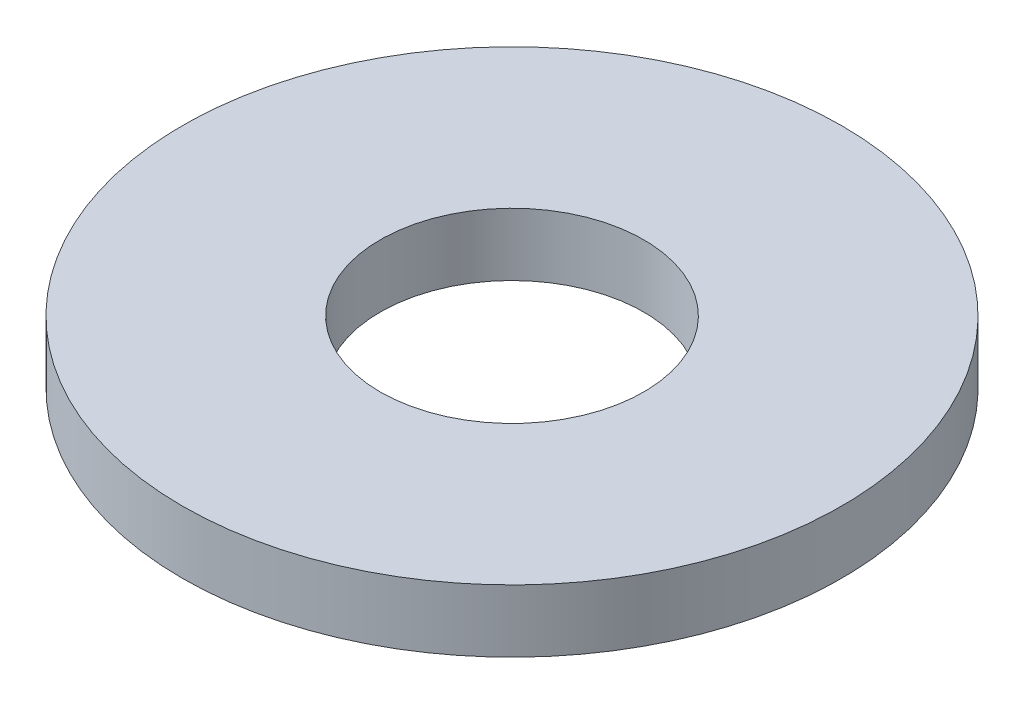
ISO-10303-21;
HEADER;
FILE_DESCRIPTION(('STEP AP214'),'2;1');
FILE_NAME('part.step','',(''),(''),'','','');
FILE_SCHEMA(('AUTOMOTIVE_DESIGN { 1 0 10303 214 1 1 1 1 }'));
ENDSEC;
DATA;
#1=APPLICATION_CONTEXT('core data for automotive mechanical design processes');
#2=APPLICATION_PROTOCOL_DEFINITION('international standard','automotive_design',2000,#1);
#3=PRODUCT_CONTEXT('',#1,'mechanical');
#4=PRODUCT('Part','Part','',(#3));
#5=PRODUCT_RELATED_PRODUCT_CATEGORY('part','',(#4));
#6=PRODUCT_DEFINITION_FORMATION('','',#4);
#7=PRODUCT_DEFINITION_CONTEXT('part definition',#1,'design');
#8=PRODUCT_DEFINITION('design','',#6,#7);
#9=PRODUCT_DEFINITION_SHAPE('','',#8);
#10=(LENGTH_UNIT() NAMED_UNIT(*) SI_UNIT(.MILLI.,.METRE.));
#11=(NAMED_UNIT(*) PLANE_ANGLE_UNIT() SI_UNIT($,.RADIAN.));
#12=(NAMED_UNIT(*) SI_UNIT($,.STERADIAN.) SOLID_ANGLE_UNIT());
#13=UNCERTAINTY_MEASURE_WITH_UNIT(LENGTH_MEASURE(1.E-05),#10,'distance_accuracy_value','');
#14=(GEOMETRIC_REPRESENTATION_CONTEXT(3) GLOBAL_UNCERTAINTY_ASSIGNED_CONTEXT((#13)) GLOBAL_UNIT_ASSIGNED_CONTEXT((#10,
#11,#12)) REPRESENTATION_CONTEXT('',''));
#15=CARTESIAN_POINT('',(0.,0.,0.));
#16=DIRECTION('',(0.,0.,1.));
#17=DIRECTION('',(1.,0.,0.));
#18=AXIS2_PLACEMENT_3D('',#15,#16,#17);
#19=CARTESIAN_POINT('',(0.,19.,0.));
#20=DIRECTION('',(0.,-1.,0.));
#21=DIRECTION('',(0.,0.,-1.));
#22=AXIS2_PLACEMENT_3D('',#19,#20,#21);
#23=CYLINDRICAL_SURFACE('',#22,100.);
#24=CARTESIAN_POINT('',(0.,19.,0.));
#25=DIRECTION('',(0.,1.,0.));
#26=DIRECTION('',(0.,0.,1.));
#27=AXIS2_PLACEMENT_3D('',#24,#25,#26);
#28=CIRCLE('',#27,100.);
#29=CARTESIAN_POINT('',(0.,19.,100.));
#30=VERTEX_POINT('',#29);
#31=EDGE_CURVE('E10',#30,#30,#28,.T.);
#32=ORIENTED_EDGE('',*,*,#31,.F.);
#33=EDGE_LOOP('',(#32));
#34=FACE_BOUND('',#33,.T.);
#35=CARTESIAN_POINT('',(0.,0.,0.));
#36=DIRECTION('',(0.,1.,0.));
#37=DIRECTION('',(0.,0.,1.));
#38=AXIS2_PLACEMENT_3D('',#35,#36,#37);
#39=CIRCLE('',#38,100.);
#40=CARTESIAN_POINT('',(0.,0.,100.));
#41=VERTEX_POINT('',#40);
#42=EDGE_CURVE('E37',#41,#41,#39,.T.);
#43=ORIENTED_EDGE('',*,*,#42,.T.);
#44=EDGE_LOOP('',(#43));
#45=FACE_BOUND('',#44,.T.);
#46=ADVANCED_FACE('F40',(#34,#45),#23,.T.);
#47=CARTESIAN_POINT('',(0.,19.,0.));
#48=DIRECTION('',(0.,1.,0.));
#49=DIRECTION('',(0.,0.,1.));
#50=AXIS2_PLACEMENT_3D('',#47,#48,#49);
#51=PLANE('',#50);
#52=CARTESIAN_POINT('',(0.,19.,0.));
#53=DIRECTION('',(0.,1.,0.));
#54=DIRECTION('',(0.,0.,1.));
#55=AXIS2_PLACEMENT_3D('',#52,#53,#54);
#56=CIRCLE('',#55,40.);
#57=CARTESIAN_POINT('',(0.,19.,40.));
#58=VERTEX_POINT('',#57);
#59=EDGE_CURVE('E50',#58,#58,#56,.T.);
#60=ORIENTED_EDGE('',*,*,#59,.F.);
#61=EDGE_LOOP('',(#60));
#62=FACE_BOUND('',#61,.T.);
#63=ORIENTED_EDGE('',*,*,#31,.T.);
#64=EDGE_LOOP('',(#63));
#65=FACE_BOUND('',#64,.T.);
#66=ADVANCED_FACE('F59',(#62,#65),#51,.T.);
#67=CARTESIAN_POINT('',(0.,0.,0.));
#68=DIRECTION('',(0.,1.,0.));
#69=DIRECTION('',(0.,0.,1.));
#70=AXIS2_PLACEMENT_3D('',#67,#68,#69);
#71=PLANE('',#70);
#72=CARTESIAN_POINT('',(0.,0.,0.));
#73=DIRECTION('',(0.,1.,0.));
#74=DIRECTION('',(0.,0.,1.));
#75=AXIS2_PLACEMENT_3D('',#72,#73,#74);
#76=CIRCLE('',#75,40.);
#77=CARTESIAN_POINT('',(0.,0.,40.));
#78=VERTEX_POINT('',#77);
#79=EDGE_CURVE('E47',#78,#78,#76,.T.);
#80=ORIENTED_EDGE('',*,*,#79,.T.);
#81=EDGE_LOOP('',(#80));
#82=FACE_BOUND('',#81,.T.);
#83=ORIENTED_EDGE('',*,*,#42,.F.);
#84=EDGE_LOOP('',(#83));
#85=FACE_BOUND('',#84,.T.);
#86=ADVANCED_FACE('F58',(#82,#85),#71,.F.);
#87=CARTESIAN_POINT('',(0.,19.,0.));
#88=DIRECTION('',(0.,-1.,0.));
#89=DIRECTION('',(0.,0.,-1.));
#90=AXIS2_PLACEMENT_3D('',#87,#88,#89);
#91=CYLINDRICAL_SURFACE('',#90,40.);
#92=ORIENTED_EDGE('',*,*,#59,.T.);
#93=EDGE_LOOP('',(#92));
#94=FACE_BOUND('',#93,.T.);
#95=ORIENTED_EDGE('',*,*,#79,.F.);
#96=EDGE_LOOP('',(#95));
#97=FACE_BOUND('',#96,.T.);
#98=ADVANCED_FACE('F54',(#94,#97),#91,.F.);
#99=CLOSED_SHELL('',(#46,#66,#86,#98));
#100=MANIFOLD_SOLID_BREP('B2',#99);
#101=ADVANCED_BREP_SHAPE_REPRESENTATION('',(#18,#100),#14);
#102=SHAPE_DEFINITION_REPRESENTATION(#9,#101);
ENDSEC;
END-ISO-10303-21;
